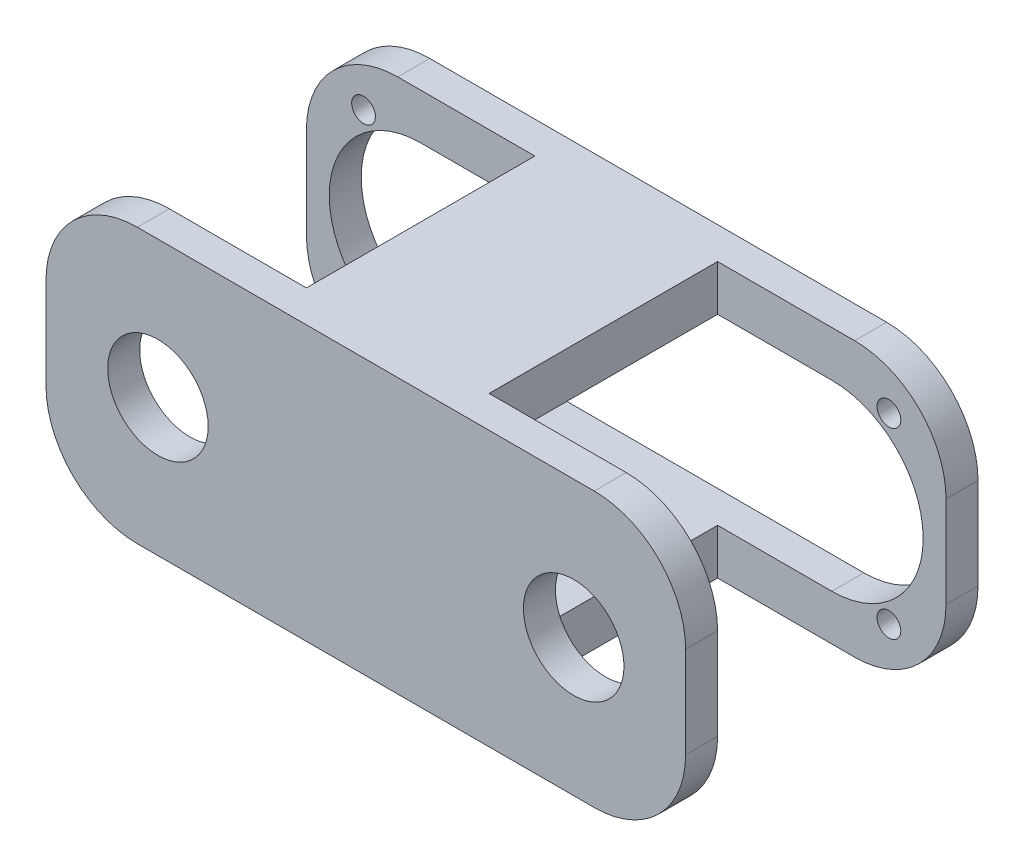
ISO-10303-21;
HEADER;
FILE_DESCRIPTION(('STEP AP214'),'2;1');
FILE_NAME('part.step','',(''),(''),'','','');
FILE_SCHEMA(('AUTOMOTIVE_DESIGN { 1 0 10303 214 1 1 1 1 }'));
ENDSEC;
DATA;
#1=APPLICATION_CONTEXT('core data for automotive mechanical design processes');
#2=APPLICATION_PROTOCOL_DEFINITION('international standard','automotive_design',2000,#1);
#3=PRODUCT_CONTEXT('',#1,'mechanical');
#4=PRODUCT('Part','Part','',(#3));
#5=PRODUCT_RELATED_PRODUCT_CATEGORY('part','',(#4));
#6=PRODUCT_DEFINITION_FORMATION('','',#4);
#7=PRODUCT_DEFINITION_CONTEXT('part definition',#1,'design');
#8=PRODUCT_DEFINITION('design','',#6,#7);
#9=PRODUCT_DEFINITION_SHAPE('','',#8);
#10=(LENGTH_UNIT() NAMED_UNIT(*) SI_UNIT(.MILLI.,.METRE.));
#11=(NAMED_UNIT(*) PLANE_ANGLE_UNIT() SI_UNIT($,.RADIAN.));
#12=(NAMED_UNIT(*) SI_UNIT($,.STERADIAN.) SOLID_ANGLE_UNIT());
#13=UNCERTAINTY_MEASURE_WITH_UNIT(LENGTH_MEASURE(1.E-05),#10,'distance_accuracy_value','');
#14=(GEOMETRIC_REPRESENTATION_CONTEXT(3) GLOBAL_UNCERTAINTY_ASSIGNED_CONTEXT((#13)) GLOBAL_UNIT_ASSIGNED_CONTEXT((#10,
#11,#12)) REPRESENTATION_CONTEXT('',''));
#15=CARTESIAN_POINT('',(0.,0.,0.));
#16=DIRECTION('',(0.,0.,1.));
#17=DIRECTION('',(1.,0.,0.));
#18=AXIS2_PLACEMENT_3D('',#15,#16,#17);
#19=CARTESIAN_POINT('',(-120.,20.,7.));
#20=DIRECTION('',(0.,0.,-1.));
#21=DIRECTION('',(-1.,0.,0.));
#22=AXIS2_PLACEMENT_3D('',#19,#20,#21);
#23=PLANE('',#22);
#24=CARTESIAN_POINT('',(-127.5,9.99999999999997,7.));
#25=DIRECTION('',(0.,0.,-1.));
#26=DIRECTION('',(-1.,0.,0.));
#27=AXIS2_PLACEMENT_3D('',#24,#25,#26);
#28=CIRCLE('',#27,2.60000000000002);
#29=CARTESIAN_POINT('',(-130.1,9.99999999999997,7.));
#30=VERTEX_POINT('',#29);
#31=EDGE_CURVE('E618',#30,#30,#28,.T.);
#32=ORIENTED_EDGE('',*,*,#31,.T.);
#33=EDGE_LOOP('',(#32));
#34=FACE_BOUND('',#33,.T.);
#35=CARTESIAN_POINT('',(-127.5,50.,7.));
#36=DIRECTION('',(0.,0.,-1.));
#37=DIRECTION('',(1.,0.,0.));
#38=AXIS2_PLACEMENT_3D('',#35,#36,#37);
#39=CIRCLE('',#38,2.60000000000002);
#40=CARTESIAN_POINT('',(-124.9,50.,7.));
#41=VERTEX_POINT('',#40);
#42=EDGE_CURVE('E626',#41,#41,#39,.T.);
#43=ORIENTED_EDGE('',*,*,#42,.T.);
#44=EDGE_LOOP('',(#43));
#45=FACE_BOUND('',#44,.T.);
#46=DIRECTION('',(0.,-1.,0.));
#47=VECTOR('',#46,1.);
#48=CARTESIAN_POINT('',(-90.,60.,7.));
#49=LINE('',#48,#47);
#50=CARTESIAN_POINT('',(-90.,60.,7.));
#51=VERTEX_POINT('',#50);
#52=CARTESIAN_POINT('',(-90.,50.,7.));
#53=VERTEX_POINT('',#52);
#54=EDGE_CURVE('E286',#51,#53,#49,.T.);
#55=ORIENTED_EDGE('',*,*,#54,.F.);
#56=DIRECTION('',(-1.,0.,0.));
#57=VECTOR('',#56,1.);
#58=CARTESIAN_POINT('',(-20.,60.,7.));
#59=LINE('',#58,#57);
#60=CARTESIAN_POINT('',(-120.,60.,7.));
#61=VERTEX_POINT('',#60);
#62=EDGE_CURVE('E400',#51,#61,#59,.T.);
#63=ORIENTED_EDGE('',*,*,#62,.T.);
#64=CARTESIAN_POINT('',(-120.,40.,7.));
#65=DIRECTION('',(0.,0.,1.));
#66=DIRECTION('',(1.,0.,0.));
#67=AXIS2_PLACEMENT_3D('',#64,#65,#66);
#68=CIRCLE('',#67,20.);
#69=CARTESIAN_POINT('',(-140.,40.,7.));
#70=VERTEX_POINT('',#69);
#71=EDGE_CURVE('E404',#61,#70,#68,.T.);
#72=ORIENTED_EDGE('',*,*,#71,.T.);
#73=DIRECTION('',(0.,-1.,0.));
#74=VECTOR('',#73,1.);
#75=CARTESIAN_POINT('',(-140.,20.,7.));
#76=LINE('',#75,#74);
#77=CARTESIAN_POINT('',(-140.,20.,7.));
#78=VERTEX_POINT('',#77);
#79=EDGE_CURVE('E407',#70,#78,#76,.T.);
#80=ORIENTED_EDGE('',*,*,#79,.T.);
#81=CARTESIAN_POINT('',(-120.,20.,7.));
#82=DIRECTION('',(0.,0.,1.));
#83=DIRECTION('',(-1.,0.,0.));
#84=AXIS2_PLACEMENT_3D('',#81,#82,#83);
#85=CIRCLE('',#84,20.);
#86=CARTESIAN_POINT('',(-120.,0.,7.));
#87=VERTEX_POINT('',#86);
#88=EDGE_CURVE('E382',#78,#87,#85,.T.);
#89=ORIENTED_EDGE('',*,*,#88,.T.);
#90=DIRECTION('',(1.,0.,0.));
#91=VECTOR('',#90,1.);
#92=CARTESIAN_POINT('',(-20.0000000000001,0.,7.));
#93=LINE('',#92,#91);
#94=CARTESIAN_POINT('',(-90.,0.,7.));
#95=VERTEX_POINT('',#94);
#96=EDGE_CURVE('E388',#87,#95,#93,.T.);
#97=ORIENTED_EDGE('',*,*,#96,.T.);
#98=DIRECTION('',(0.,-1.,0.));
#99=VECTOR('',#98,1.);
#100=CARTESIAN_POINT('',(-90.,0.,7.));
#101=LINE('',#100,#99);
#102=CARTESIAN_POINT('',(-90.,9.99999999999999,7.));
#103=VERTEX_POINT('',#102);
#104=EDGE_CURVE('E290',#103,#95,#101,.T.);
#105=ORIENTED_EDGE('',*,*,#104,.F.);
#106=DIRECTION('',(1.,0.,0.));
#107=VECTOR('',#106,1.);
#108=CARTESIAN_POINT('',(-115.,9.99999999999999,7.));
#109=LINE('',#108,#107);
#110=CARTESIAN_POINT('',(-115.,9.99999999999999,7.));
#111=VERTEX_POINT('',#110);
#112=EDGE_CURVE('E350',#111,#103,#109,.T.);
#113=ORIENTED_EDGE('',*,*,#112,.F.);
#114=CARTESIAN_POINT('',(-115.,30.,7.));
#115=DIRECTION('',(0.,0.,1.));
#116=DIRECTION('',(1.,0.,0.));
#117=AXIS2_PLACEMENT_3D('',#114,#115,#116);
#118=CIRCLE('',#117,20.);
#119=CARTESIAN_POINT('',(-115.,50.,7.));
#120=VERTEX_POINT('',#119);
#121=EDGE_CURVE('E345',#120,#111,#118,.T.);
#122=ORIENTED_EDGE('',*,*,#121,.F.);
#123=DIRECTION('',(-1.,0.,0.));
#124=VECTOR('',#123,1.);
#125=CARTESIAN_POINT('',(-115.,50.,7.));
#126=LINE('',#125,#124);
#127=EDGE_CURVE('E61',#53,#120,#126,.T.);
#128=ORIENTED_EDGE('',*,*,#127,.F.);
#129=EDGE_LOOP('',(#55,#63,#72,#80,#89,#97,#105,#113,#122,#128));
#130=FACE_BOUND('',#129,.T.);
#131=ADVANCED_FACE('F45',(#34,#45,#130),#23,.F.);
#132=CARTESIAN_POINT('',(-12.5,9.99999999999998,7.));
#133=DIRECTION('',(0.,0.,-1.));
#134=DIRECTION('',(1.,0.,0.));
#135=AXIS2_PLACEMENT_3D('',#132,#133,#134);
#136=CIRCLE('',#135,2.6);
#137=CARTESIAN_POINT('',(-9.9,9.99999999999998,7.));
#138=VERTEX_POINT('',#137);
#139=EDGE_CURVE('E610',#138,#138,#136,.T.);
#140=ORIENTED_EDGE('',*,*,#139,.T.);
#141=EDGE_LOOP('',(#140));
#142=FACE_BOUND('',#141,.T.);
#143=CARTESIAN_POINT('',(-12.5,50.,7.));
#144=DIRECTION('',(0.,0.,-1.));
#145=DIRECTION('',(-1.,0.,0.));
#146=AXIS2_PLACEMENT_3D('',#143,#144,#145);
#147=CIRCLE('',#146,2.60000000000001);
#148=CARTESIAN_POINT('',(-15.1,50.,7.));
#149=VERTEX_POINT('',#148);
#150=EDGE_CURVE('E598',#149,#149,#147,.T.);
#151=ORIENTED_EDGE('',*,*,#150,.T.);
#152=EDGE_LOOP('',(#151));
#153=FACE_BOUND('',#152,.T.);
#154=DIRECTION('',(0.,1.,0.));
#155=VECTOR('',#154,1.);
#156=CARTESIAN_POINT('',(-50.,60.,7.));
#157=LINE('',#156,#155);
#158=CARTESIAN_POINT('',(-50.,50.,7.));
#159=VERTEX_POINT('',#158);
#160=CARTESIAN_POINT('',(-50.,60.,7.));
#161=VERTEX_POINT('',#160);
#162=EDGE_CURVE('E69',#159,#161,#157,.T.);
#163=ORIENTED_EDGE('',*,*,#162,.F.);
#164=CARTESIAN_POINT('',(-25.,50.,7.));
#165=VERTEX_POINT('',#164);
#166=EDGE_CURVE('E342',#165,#159,#126,.T.);
#167=ORIENTED_EDGE('',*,*,#166,.F.);
#168=CARTESIAN_POINT('',(-25.,30.,7.));
#169=DIRECTION('',(0.,0.,1.));
#170=DIRECTION('',(1.,0.,0.));
#171=AXIS2_PLACEMENT_3D('',#168,#169,#170);
#172=CIRCLE('',#171,20.);
#173=CARTESIAN_POINT('',(-25.,9.99999999999999,7.));
#174=VERTEX_POINT('',#173);
#175=EDGE_CURVE('E338',#174,#165,#172,.T.);
#176=ORIENTED_EDGE('',*,*,#175,.F.);
#177=CARTESIAN_POINT('',(-50.,9.99999999999999,7.));
#178=VERTEX_POINT('',#177);
#179=EDGE_CURVE('E349',#178,#174,#109,.T.);
#180=ORIENTED_EDGE('',*,*,#179,.F.);
#181=DIRECTION('',(0.,1.,0.));
#182=VECTOR('',#181,1.);
#183=CARTESIAN_POINT('',(-50.,0.,7.));
#184=LINE('',#183,#182);
#185=CARTESIAN_POINT('',(-50.,0.,7.));
#186=VERTEX_POINT('',#185);
#187=EDGE_CURVE('E320',#186,#178,#184,.T.);
#188=ORIENTED_EDGE('',*,*,#187,.F.);
#189=CARTESIAN_POINT('',(-20.0000000000001,0.,7.));
#190=VERTEX_POINT('',#189);
#191=EDGE_CURVE('E386',#186,#190,#93,.T.);
#192=ORIENTED_EDGE('',*,*,#191,.T.);
#193=CARTESIAN_POINT('',(-20.,20.,7.));
#194=DIRECTION('',(0.,0.,1.));
#195=DIRECTION('',(1.,0.,0.));
#196=AXIS2_PLACEMENT_3D('',#193,#194,#195);
#197=CIRCLE('',#196,20.);
#198=CARTESIAN_POINT('',(0.,20.,7.));
#199=VERTEX_POINT('',#198);
#200=EDGE_CURVE('E391',#190,#199,#197,.T.);
#201=ORIENTED_EDGE('',*,*,#200,.T.);
#202=DIRECTION('',(0.,1.,0.));
#203=VECTOR('',#202,1.);
#204=CARTESIAN_POINT('',(0.,20.0000000000001,7.));
#205=LINE('',#204,#203);
#206=CARTESIAN_POINT('',(0.,40.,7.));
#207=VERTEX_POINT('',#206);
#208=EDGE_CURVE('E394',#199,#207,#205,.T.);
#209=ORIENTED_EDGE('',*,*,#208,.T.);
#210=CARTESIAN_POINT('',(-20.,40.,7.));
#211=DIRECTION('',(0.,0.,1.));
#212=DIRECTION('',(1.,0.,0.));
#213=AXIS2_PLACEMENT_3D('',#210,#211,#212);
#214=CIRCLE('',#213,20.);
#215=CARTESIAN_POINT('',(-20.,60.,7.));
#216=VERTEX_POINT('',#215);
#217=EDGE_CURVE('E397',#207,#216,#214,.T.);
#218=ORIENTED_EDGE('',*,*,#217,.T.);
#219=EDGE_CURVE('E401',#216,#161,#59,.T.);
#220=ORIENTED_EDGE('',*,*,#219,.T.);
#221=EDGE_LOOP('',(#163,#167,#176,#180,#188,#192,#201,#209,#218,#220));
#222=FACE_BOUND('',#221,.T.);
#223=ADVANCED_FACE('F481',(#142,#153,#222),#23,.F.);
#224=CARTESIAN_POINT('',(-120.,20.,0.));
#225=DIRECTION('',(0.,0.,-1.));
#226=DIRECTION('',(-1.,0.,0.));
#227=AXIS2_PLACEMENT_3D('',#224,#225,#226);
#228=PLANE('',#227);
#229=CARTESIAN_POINT('',(-12.5,9.99999999999998,0.));
#230=DIRECTION('',(0.,0.,-1.));
#231=DIRECTION('',(1.,0.,0.));
#232=AXIS2_PLACEMENT_3D('',#229,#230,#231);
#233=CIRCLE('',#232,2.6);
#234=CARTESIAN_POINT('',(-9.9,9.99999999999998,0.));
#235=VERTEX_POINT('',#234);
#236=EDGE_CURVE('E614',#235,#235,#233,.T.);
#237=ORIENTED_EDGE('',*,*,#236,.F.);
#238=EDGE_LOOP('',(#237));
#239=FACE_BOUND('',#238,.T.);
#240=CARTESIAN_POINT('',(-127.5,9.99999999999997,0.));
#241=DIRECTION('',(0.,0.,-1.));
#242=DIRECTION('',(-1.,0.,0.));
#243=AXIS2_PLACEMENT_3D('',#240,#241,#242);
#244=CIRCLE('',#243,2.60000000000002);
#245=CARTESIAN_POINT('',(-130.1,9.99999999999997,0.));
#246=VERTEX_POINT('',#245);
#247=EDGE_CURVE('E622',#246,#246,#244,.T.);
#248=ORIENTED_EDGE('',*,*,#247,.F.);
#249=EDGE_LOOP('',(#248));
#250=FACE_BOUND('',#249,.T.);
#251=CARTESIAN_POINT('',(-127.5,50.,0.));
#252=DIRECTION('',(0.,0.,-1.));
#253=DIRECTION('',(1.,0.,0.));
#254=AXIS2_PLACEMENT_3D('',#251,#252,#253);
#255=CIRCLE('',#254,2.60000000000002);
#256=CARTESIAN_POINT('',(-124.9,50.,0.));
#257=VERTEX_POINT('',#256);
#258=EDGE_CURVE('E606',#257,#257,#255,.T.);
#259=ORIENTED_EDGE('',*,*,#258,.F.);
#260=EDGE_LOOP('',(#259));
#261=FACE_BOUND('',#260,.T.);
#262=CARTESIAN_POINT('',(-12.5,50.,0.));
#263=DIRECTION('',(0.,0.,-1.));
#264=DIRECTION('',(-1.,0.,0.));
#265=AXIS2_PLACEMENT_3D('',#262,#263,#264);
#266=CIRCLE('',#265,2.60000000000001);
#267=CARTESIAN_POINT('',(-15.1,50.,0.));
#268=VERTEX_POINT('',#267);
#269=EDGE_CURVE('E602',#268,#268,#266,.T.);
#270=ORIENTED_EDGE('',*,*,#269,.F.);
#271=EDGE_LOOP('',(#270));
#272=FACE_BOUND('',#271,.T.);
#273=CARTESIAN_POINT('',(-120.,20.,0.));
#274=DIRECTION('',(0.,0.,1.));
#275=DIRECTION('',(-1.,0.,0.));
#276=AXIS2_PLACEMENT_3D('',#273,#274,#275);
#277=CIRCLE('',#276,20.);
#278=CARTESIAN_POINT('',(-140.,20.,0.));
#279=VERTEX_POINT('',#278);
#280=CARTESIAN_POINT('',(-120.,0.,0.));
#281=VERTEX_POINT('',#280);
#282=EDGE_CURVE('E381',#279,#281,#277,.T.);
#283=ORIENTED_EDGE('',*,*,#282,.F.);
#284=DIRECTION('',(0.,-1.,0.));
#285=VECTOR('',#284,1.);
#286=CARTESIAN_POINT('',(-140.,20.,0.));
#287=LINE('',#286,#285);
#288=CARTESIAN_POINT('',(-140.,40.,0.));
#289=VERTEX_POINT('',#288);
#290=EDGE_CURVE('E387',#289,#279,#287,.T.);
#291=ORIENTED_EDGE('',*,*,#290,.F.);
#292=CARTESIAN_POINT('',(-120.,40.,0.));
#293=DIRECTION('',(0.,0.,1.));
#294=DIRECTION('',(1.,0.,0.));
#295=AXIS2_PLACEMENT_3D('',#292,#293,#294);
#296=CIRCLE('',#295,20.);
#297=CARTESIAN_POINT('',(-120.,60.,0.));
#298=VERTEX_POINT('',#297);
#299=EDGE_CURVE('E429',#298,#289,#296,.T.);
#300=ORIENTED_EDGE('',*,*,#299,.F.);
#301=DIRECTION('',(-1.,0.,0.));
#302=VECTOR('',#301,1.);
#303=CARTESIAN_POINT('',(-20.,60.,0.));
#304=LINE('',#303,#302);
#305=CARTESIAN_POINT('',(-20.,60.,0.));
#306=VERTEX_POINT('',#305);
#307=EDGE_CURVE('E426',#306,#298,#304,.T.);
#308=ORIENTED_EDGE('',*,*,#307,.F.);
#309=CARTESIAN_POINT('',(-20.,40.,0.));
#310=DIRECTION('',(0.,0.,1.));
#311=DIRECTION('',(1.,0.,0.));
#312=AXIS2_PLACEMENT_3D('',#309,#310,#311);
#313=CIRCLE('',#312,20.);
#314=CARTESIAN_POINT('',(0.,40.,0.));
#315=VERTEX_POINT('',#314);
#316=EDGE_CURVE('E423',#315,#306,#313,.T.);
#317=ORIENTED_EDGE('',*,*,#316,.F.);
#318=DIRECTION('',(0.,1.,0.));
#319=VECTOR('',#318,1.);
#320=CARTESIAN_POINT('',(0.,20.0000000000001,0.));
#321=LINE('',#320,#319);
#322=CARTESIAN_POINT('',(0.,20.,0.));
#323=VERTEX_POINT('',#322);
#324=EDGE_CURVE('E420',#323,#315,#321,.T.);
#325=ORIENTED_EDGE('',*,*,#324,.F.);
#326=CARTESIAN_POINT('',(-20.,20.,0.));
#327=DIRECTION('',(0.,0.,1.));
#328=DIRECTION('',(1.,0.,0.));
#329=AXIS2_PLACEMENT_3D('',#326,#327,#328);
#330=CIRCLE('',#329,20.);
#331=CARTESIAN_POINT('',(-20.0000000000001,0.,0.));
#332=VERTEX_POINT('',#331);
#333=EDGE_CURVE('E417',#332,#323,#330,.T.);
#334=ORIENTED_EDGE('',*,*,#333,.F.);
#335=DIRECTION('',(1.,0.,0.));
#336=VECTOR('',#335,1.);
#337=CARTESIAN_POINT('',(-20.0000000000001,0.,0.));
#338=LINE('',#337,#336);
#339=EDGE_CURVE('E414',#281,#332,#338,.T.);
#340=ORIENTED_EDGE('',*,*,#339,.F.);
#341=EDGE_LOOP('',(#283,#291,#300,#308,#317,#325,#334,#340));
#342=FACE_BOUND('',#341,.T.);
#343=DIRECTION('',(1.,0.,0.));
#344=VECTOR('',#343,1.);
#345=CARTESIAN_POINT('',(-115.,9.99999999999999,0.));
#346=LINE('',#345,#344);
#347=CARTESIAN_POINT('',(-115.,9.99999999999999,0.));
#348=VERTEX_POINT('',#347);
#349=CARTESIAN_POINT('',(-25.,9.99999999999999,0.));
#350=VERTEX_POINT('',#349);
#351=EDGE_CURVE('E341',#348,#350,#346,.T.);
#352=ORIENTED_EDGE('',*,*,#351,.T.);
#353=CARTESIAN_POINT('',(-25.,30.,0.));
#354=DIRECTION('',(0.,0.,1.));
#355=DIRECTION('',(-1.,0.,0.));
#356=AXIS2_PLACEMENT_3D('',#353,#354,#355);
#357=CIRCLE('',#356,20.);
#358=CARTESIAN_POINT('',(-25.,50.,0.));
#359=VERTEX_POINT('',#358);
#360=EDGE_CURVE('E306',#350,#359,#357,.T.);
#361=ORIENTED_EDGE('',*,*,#360,.T.);
#362=DIRECTION('',(-1.,0.,0.));
#363=VECTOR('',#362,1.);
#364=CARTESIAN_POINT('',(-115.,50.,0.));
#365=LINE('',#364,#363);
#366=CARTESIAN_POINT('',(-115.,50.,0.));
#367=VERTEX_POINT('',#366);
#368=EDGE_CURVE('E358',#359,#367,#365,.T.);
#369=ORIENTED_EDGE('',*,*,#368,.T.);
#370=CARTESIAN_POINT('',(-115.,30.,0.));
#371=DIRECTION('',(0.,0.,1.));
#372=DIRECTION('',(1.,0.,0.));
#373=AXIS2_PLACEMENT_3D('',#370,#371,#372);
#374=CIRCLE('',#373,20.);
#375=EDGE_CURVE('E362',#367,#348,#374,.T.);
#376=ORIENTED_EDGE('',*,*,#375,.T.);
#377=EDGE_LOOP('',(#352,#361,#369,#376));
#378=FACE_BOUND('',#377,.T.);
#379=ADVANCED_FACE('F468',(#239,#250,#261,#272,#342,#378),#228,.T.);
#380=CARTESIAN_POINT('',(-120.,20.,7.));
#381=DIRECTION('',(0.,0.,-1.));
#382=DIRECTION('',(-1.,0.,0.));
#383=AXIS2_PLACEMENT_3D('',#380,#381,#382);
#384=CYLINDRICAL_SURFACE('',#383,20.);
#385=ORIENTED_EDGE('',*,*,#282,.T.);
#386=DIRECTION('',(0.,0.,-1.));
#387=VECTOR('',#386,1.);
#388=CARTESIAN_POINT('',(-120.,0.,7.));
#389=LINE('',#388,#387);
#390=EDGE_CURVE('E11',#87,#281,#389,.T.);
#391=ORIENTED_EDGE('',*,*,#390,.F.);
#392=ORIENTED_EDGE('',*,*,#88,.F.);
#393=DIRECTION('',(0.,0.,-1.));
#394=VECTOR('',#393,1.);
#395=CARTESIAN_POINT('',(-140.,20.,7.));
#396=LINE('',#395,#394);
#397=EDGE_CURVE('E410',#78,#279,#396,.T.);
#398=ORIENTED_EDGE('',*,*,#397,.T.);
#399=EDGE_LOOP('',(#385,#391,#392,#398));
#400=FACE_BOUND('',#399,.T.);
#401=ADVANCED_FACE('F47',(#400),#384,.T.);
#402=CARTESIAN_POINT('',(-20.0000000000001,0.,7.));
#403=DIRECTION('',(0.,1.,0.));
#404=DIRECTION('',(-1.,0.,0.));
#405=AXIS2_PLACEMENT_3D('',#402,#403,#404);
#406=PLANE('',#405);
#407=ORIENTED_EDGE('',*,*,#339,.T.);
#408=DIRECTION('',(0.,0.,-1.));
#409=VECTOR('',#408,1.);
#410=CARTESIAN_POINT('',(-20.0000000000001,0.,7.));
#411=LINE('',#410,#409);
#412=EDGE_CURVE('E54',#190,#332,#411,.T.);
#413=ORIENTED_EDGE('',*,*,#412,.F.);
#414=ORIENTED_EDGE('',*,*,#191,.F.);
#415=DIRECTION('',(0.,0.,-1.));
#416=VECTOR('',#415,1.);
#417=CARTESIAN_POINT('',(-50.,0.,57.));
#418=LINE('',#417,#416);
#419=CARTESIAN_POINT('',(-50.,0.,57.));
#420=VERTEX_POINT('',#419);
#421=EDGE_CURVE('E267',#420,#186,#418,.T.);
#422=ORIENTED_EDGE('',*,*,#421,.F.);
#423=DIRECTION('',(1.,0.,0.));
#424=VECTOR('',#423,1.);
#425=CARTESIAN_POINT('',(-120.,0.,57.));
#426=LINE('',#425,#424);
#427=CARTESIAN_POINT('',(-20.0000000000001,0.,57.));
#428=VERTEX_POINT('',#427);
#429=EDGE_CURVE('E505',#420,#428,#426,.T.);
#430=ORIENTED_EDGE('',*,*,#429,.T.);
#431=DIRECTION('',(0.,0.,-1.));
#432=VECTOR('',#431,1.);
#433=CARTESIAN_POINT('',(-20.0000000000001,0.,64.));
#434=LINE('',#433,#432);
#435=CARTESIAN_POINT('',(-20.0000000000001,0.,64.));
#436=VERTEX_POINT('',#435);
#437=EDGE_CURVE('E240',#436,#428,#434,.T.);
#438=ORIENTED_EDGE('',*,*,#437,.F.);
#439=DIRECTION('',(1.,0.,0.));
#440=VECTOR('',#439,1.);
#441=CARTESIAN_POINT('',(-120.,0.,64.));
#442=LINE('',#441,#440);
#443=CARTESIAN_POINT('',(-120.,0.,64.));
#444=VERTEX_POINT('',#443);
#445=EDGE_CURVE('E232',#444,#436,#442,.T.);
#446=ORIENTED_EDGE('',*,*,#445,.F.);
#447=DIRECTION('',(0.,0.,-1.));
#448=VECTOR('',#447,1.);
#449=CARTESIAN_POINT('',(-120.,0.,64.));
#450=LINE('',#449,#448);
#451=CARTESIAN_POINT('',(-120.,0.,57.));
#452=VERTEX_POINT('',#451);
#453=EDGE_CURVE('E237',#444,#452,#450,.T.);
#454=ORIENTED_EDGE('',*,*,#453,.T.);
#455=CARTESIAN_POINT('',(-90.,0.,57.));
#456=VERTEX_POINT('',#455);
#457=EDGE_CURVE('E502',#452,#456,#426,.T.);
#458=ORIENTED_EDGE('',*,*,#457,.T.);
#459=DIRECTION('',(0.,0.,-1.));
#460=VECTOR('',#459,1.);
#461=CARTESIAN_POINT('',(-90.,0.,57.));
#462=LINE('',#461,#460);
#463=EDGE_CURVE('E262',#456,#95,#462,.T.);
#464=ORIENTED_EDGE('',*,*,#463,.T.);
#465=ORIENTED_EDGE('',*,*,#96,.F.);
#466=ORIENTED_EDGE('',*,*,#390,.T.);
#467=EDGE_LOOP('',(#407,#413,#414,#422,#430,#438,#446,#454,#458,#464,#465,#466));
#468=FACE_BOUND('',#467,.T.);
#469=ADVANCED_FACE('F234',(#468),#406,.F.);
#470=CARTESIAN_POINT('',(-20.,20.,7.));
#471=DIRECTION('',(0.,0.,-1.));
#472=DIRECTION('',(-1.,0.,0.));
#473=AXIS2_PLACEMENT_3D('',#470,#471,#472);
#474=CYLINDRICAL_SURFACE('',#473,20.);
#475=ORIENTED_EDGE('',*,*,#333,.T.);
#476=DIRECTION('',(0.,0.,-1.));
#477=VECTOR('',#476,1.);
#478=CARTESIAN_POINT('',(0.,20.,7.));
#479=LINE('',#478,#477);
#480=EDGE_CURVE('E453',#199,#323,#479,.T.);
#481=ORIENTED_EDGE('',*,*,#480,.F.);
#482=ORIENTED_EDGE('',*,*,#200,.F.);
#483=ORIENTED_EDGE('',*,*,#412,.T.);
#484=EDGE_LOOP('',(#475,#481,#482,#483));
#485=FACE_BOUND('',#484,.T.);
#486=ADVANCED_FACE('F462',(#485),#474,.T.);
#487=CARTESIAN_POINT('',(0.,20.0000000000001,7.));
#488=DIRECTION('',(-1.,0.,0.));
#489=DIRECTION('',(0.,0.,1.));
#490=AXIS2_PLACEMENT_3D('',#487,#488,#489);
#491=PLANE('',#490);
#492=ORIENTED_EDGE('',*,*,#324,.T.);
#493=DIRECTION('',(0.,0.,-1.));
#494=VECTOR('',#493,1.);
#495=CARTESIAN_POINT('',(0.,40.,7.));
#496=LINE('',#495,#494);
#497=EDGE_CURVE('E449',#207,#315,#496,.T.);
#498=ORIENTED_EDGE('',*,*,#497,.F.);
#499=ORIENTED_EDGE('',*,*,#208,.F.);
#500=ORIENTED_EDGE('',*,*,#480,.T.);
#501=EDGE_LOOP('',(#492,#498,#499,#500));
#502=FACE_BOUND('',#501,.T.);
#503=ADVANCED_FACE('F474',(#502),#491,.F.);
#504=CARTESIAN_POINT('',(-20.,40.,7.));
#505=DIRECTION('',(0.,0.,-1.));
#506=DIRECTION('',(-1.,0.,0.));
#507=AXIS2_PLACEMENT_3D('',#504,#505,#506);
#508=CYLINDRICAL_SURFACE('',#507,20.);
#509=ORIENTED_EDGE('',*,*,#316,.T.);
#510=DIRECTION('',(0.,0.,-1.));
#511=VECTOR('',#510,1.);
#512=CARTESIAN_POINT('',(-20.,60.,7.));
#513=LINE('',#512,#511);
#514=EDGE_CURVE('E445',#216,#306,#513,.T.);
#515=ORIENTED_EDGE('',*,*,#514,.F.);
#516=ORIENTED_EDGE('',*,*,#217,.F.);
#517=ORIENTED_EDGE('',*,*,#497,.T.);
#518=EDGE_LOOP('',(#509,#515,#516,#517));
#519=FACE_BOUND('',#518,.T.);
#520=ADVANCED_FACE('F478',(#519),#508,.T.);
#521=CARTESIAN_POINT('',(-20.,60.,7.));
#522=DIRECTION('',(0.,-1.,0.));
#523=DIRECTION('',(1.,0.,0.));
#524=AXIS2_PLACEMENT_3D('',#521,#522,#523);
#525=PLANE('',#524);
#526=ORIENTED_EDGE('',*,*,#307,.T.);
#527=DIRECTION('',(0.,0.,-1.));
#528=VECTOR('',#527,1.);
#529=CARTESIAN_POINT('',(-120.,60.,7.));
#530=LINE('',#529,#528);
#531=EDGE_CURVE('E441',#61,#298,#530,.T.);
#532=ORIENTED_EDGE('',*,*,#531,.F.);
#533=ORIENTED_EDGE('',*,*,#62,.F.);
#534=DIRECTION('',(0.,0.,-1.));
#535=VECTOR('',#534,1.);
#536=CARTESIAN_POINT('',(-90.,60.,57.));
#537=LINE('',#536,#535);
#538=CARTESIAN_POINT('',(-90.,60.,57.));
#539=VERTEX_POINT('',#538);
#540=EDGE_CURVE('E285',#539,#51,#537,.T.);
#541=ORIENTED_EDGE('',*,*,#540,.F.);
#542=DIRECTION('',(-1.,0.,0.));
#543=VECTOR('',#542,1.);
#544=CARTESIAN_POINT('',(-120.,60.,57.));
#545=LINE('',#544,#543);
#546=CARTESIAN_POINT('',(-120.,60.,57.));
#547=VERTEX_POINT('',#546);
#548=EDGE_CURVE('E519',#539,#547,#545,.T.);
#549=ORIENTED_EDGE('',*,*,#548,.T.);
#550=DIRECTION('',(0.,0.,-1.));
#551=VECTOR('',#550,1.);
#552=CARTESIAN_POINT('',(-120.,60.,64.));
#553=LINE('',#552,#551);
#554=CARTESIAN_POINT('',(-120.,60.,64.));
#555=VERTEX_POINT('',#554);
#556=EDGE_CURVE('E536',#555,#547,#553,.T.);
#557=ORIENTED_EDGE('',*,*,#556,.F.);
#558=DIRECTION('',(-1.,0.,0.));
#559=VECTOR('',#558,1.);
#560=CARTESIAN_POINT('',(-120.,60.,64.));
#561=LINE('',#560,#559);
#562=CARTESIAN_POINT('',(-20.,60.,64.));
#563=VERTEX_POINT('',#562);
#564=EDGE_CURVE('E569',#563,#555,#561,.T.);
#565=ORIENTED_EDGE('',*,*,#564,.F.);
#566=DIRECTION('',(0.,0.,-1.));
#567=VECTOR('',#566,1.);
#568=CARTESIAN_POINT('',(-20.,60.,64.));
#569=LINE('',#568,#567);
#570=CARTESIAN_POINT('',(-20.,60.,57.));
#571=VERTEX_POINT('',#570);
#572=EDGE_CURVE('E540',#563,#571,#569,.T.);
#573=ORIENTED_EDGE('',*,*,#572,.T.);
#574=CARTESIAN_POINT('',(-50.,60.,57.));
#575=VERTEX_POINT('',#574);
#576=EDGE_CURVE('E520',#571,#575,#545,.T.);
#577=ORIENTED_EDGE('',*,*,#576,.T.);
#578=DIRECTION('',(0.,0.,-1.));
#579=VECTOR('',#578,1.);
#580=CARTESIAN_POINT('',(-50.,60.,57.));
#581=LINE('',#580,#579);
#582=EDGE_CURVE('E296',#575,#161,#581,.T.);
#583=ORIENTED_EDGE('',*,*,#582,.T.);
#584=ORIENTED_EDGE('',*,*,#219,.F.);
#585=ORIENTED_EDGE('',*,*,#514,.T.);
#586=EDGE_LOOP('',(#526,#532,#533,#541,#549,#557,#565,#573,#577,#583,#584,#585));
#587=FACE_BOUND('',#586,.T.);
#588=ADVANCED_FACE('F567',(#587),#525,.F.);
#589=CARTESIAN_POINT('',(-120.,40.,7.));
#590=DIRECTION('',(0.,0.,-1.));
#591=DIRECTION('',(-1.,0.,0.));
#592=AXIS2_PLACEMENT_3D('',#589,#590,#591);
#593=CYLINDRICAL_SURFACE('',#592,20.);
#594=ORIENTED_EDGE('',*,*,#299,.T.);
#595=DIRECTION('',(0.,0.,-1.));
#596=VECTOR('',#595,1.);
#597=CARTESIAN_POINT('',(-140.,40.,7.));
#598=LINE('',#597,#596);
#599=EDGE_CURVE('E437',#70,#289,#598,.T.);
#600=ORIENTED_EDGE('',*,*,#599,.F.);
#601=ORIENTED_EDGE('',*,*,#71,.F.);
#602=ORIENTED_EDGE('',*,*,#531,.T.);
#603=EDGE_LOOP('',(#594,#600,#601,#602));
#604=FACE_BOUND('',#603,.T.);
#605=ADVANCED_FACE('F674',(#604),#593,.T.);
#606=CARTESIAN_POINT('',(-140.,20.,7.));
#607=DIRECTION('',(1.,0.,0.));
#608=DIRECTION('',(0.,0.,-1.));
#609=AXIS2_PLACEMENT_3D('',#606,#607,#608);
#610=PLANE('',#609);
#611=ORIENTED_EDGE('',*,*,#290,.T.);
#612=ORIENTED_EDGE('',*,*,#397,.F.);
#613=ORIENTED_EDGE('',*,*,#79,.F.);
#614=ORIENTED_EDGE('',*,*,#599,.T.);
#615=EDGE_LOOP('',(#611,#612,#613,#614));
#616=FACE_BOUND('',#615,.T.);
#617=ADVANCED_FACE('F671',(#616),#610,.F.);
#618=CARTESIAN_POINT('',(-25.,30.,7.));
#619=DIRECTION('',(0.,0.,-1.));
#620=DIRECTION('',(-1.,0.,0.));
#621=AXIS2_PLACEMENT_3D('',#618,#619,#620);
#622=CYLINDRICAL_SURFACE('',#621,20.);
#623=ORIENTED_EDGE('',*,*,#360,.F.);
#624=DIRECTION('',(0.,0.,-1.));
#625=VECTOR('',#624,1.);
#626=CARTESIAN_POINT('',(-25.,9.99999999999999,7.));
#627=LINE('',#626,#625);
#628=EDGE_CURVE('E354',#174,#350,#627,.T.);
#629=ORIENTED_EDGE('',*,*,#628,.F.);
#630=ORIENTED_EDGE('',*,*,#175,.T.);
#631=DIRECTION('',(0.,0.,-1.));
#632=VECTOR('',#631,1.);
#633=CARTESIAN_POINT('',(-25.,50.,7.));
#634=LINE('',#633,#632);
#635=EDGE_CURVE('E378',#165,#359,#634,.T.);
#636=ORIENTED_EDGE('',*,*,#635,.T.);
#637=EDGE_LOOP('',(#623,#629,#630,#636));
#638=FACE_BOUND('',#637,.T.);
#639=ADVANCED_FACE('F668',(#638),#622,.F.);
#640=CARTESIAN_POINT('',(-115.,50.,7.));
#641=DIRECTION('',(0.,-1.,0.));
#642=DIRECTION('',(0.,0.,-1.));
#643=AXIS2_PLACEMENT_3D('',#640,#641,#642);
#644=PLANE('',#643);
#645=ORIENTED_EDGE('',*,*,#368,.F.);
#646=ORIENTED_EDGE('',*,*,#635,.F.);
#647=ORIENTED_EDGE('',*,*,#166,.T.);
#648=DIRECTION('',(0.,0.,-1.));
#649=VECTOR('',#648,1.);
#650=CARTESIAN_POINT('',(-50.,50.,57.));
#651=LINE('',#650,#649);
#652=CARTESIAN_POINT('',(-50.,50.,57.));
#653=VERTEX_POINT('',#652);
#654=EDGE_CURVE('E300',#653,#159,#651,.T.);
#655=ORIENTED_EDGE('',*,*,#654,.F.);
#656=DIRECTION('',(1.,0.,0.));
#657=VECTOR('',#656,1.);
#658=CARTESIAN_POINT('',(-90.,50.,57.));
#659=LINE('',#658,#657);
#660=CARTESIAN_POINT('',(-90.,50.,57.));
#661=VERTEX_POINT('',#660);
#662=EDGE_CURVE('E277',#661,#653,#659,.T.);
#663=ORIENTED_EDGE('',*,*,#662,.F.);
#664=DIRECTION('',(0.,0.,-1.));
#665=VECTOR('',#664,1.);
#666=CARTESIAN_POINT('',(-90.,50.,57.));
#667=LINE('',#666,#665);
#668=EDGE_CURVE('E304',#661,#53,#667,.T.);
#669=ORIENTED_EDGE('',*,*,#668,.T.);
#670=ORIENTED_EDGE('',*,*,#127,.T.);
#671=DIRECTION('',(0.,0.,-1.));
#672=VECTOR('',#671,1.);
#673=CARTESIAN_POINT('',(-115.,50.,7.));
#674=LINE('',#673,#672);
#675=EDGE_CURVE('E374',#120,#367,#674,.T.);
#676=ORIENTED_EDGE('',*,*,#675,.T.);
#677=EDGE_LOOP('',(#645,#646,#647,#655,#663,#669,#670,#676));
#678=FACE_BOUND('',#677,.T.);
#679=ADVANCED_FACE('F488',(#678),#644,.T.);
#680=CARTESIAN_POINT('',(-115.,30.,7.));
#681=DIRECTION('',(0.,0.,-1.));
#682=DIRECTION('',(-1.,0.,0.));
#683=AXIS2_PLACEMENT_3D('',#680,#681,#682);
#684=CYLINDRICAL_SURFACE('',#683,20.);
#685=ORIENTED_EDGE('',*,*,#375,.F.);
#686=ORIENTED_EDGE('',*,*,#675,.F.);
#687=ORIENTED_EDGE('',*,*,#121,.T.);
#688=DIRECTION('',(0.,0.,-1.));
#689=VECTOR('',#688,1.);
#690=CARTESIAN_POINT('',(-115.,9.99999999999999,7.));
#691=LINE('',#690,#689);
#692=EDGE_CURVE('E371',#111,#348,#691,.T.);
#693=ORIENTED_EDGE('',*,*,#692,.T.);
#694=EDGE_LOOP('',(#685,#686,#687,#693));
#695=FACE_BOUND('',#694,.T.);
#696=ADVANCED_FACE('F491',(#695),#684,.F.);
#697=CARTESIAN_POINT('',(-115.,9.99999999999999,7.));
#698=DIRECTION('',(0.,1.,0.));
#699=DIRECTION('',(0.,0.,1.));
#700=AXIS2_PLACEMENT_3D('',#697,#698,#699);
#701=PLANE('',#700);
#702=ORIENTED_EDGE('',*,*,#351,.F.);
#703=ORIENTED_EDGE('',*,*,#692,.F.);
#704=ORIENTED_EDGE('',*,*,#112,.T.);
#705=DIRECTION('',(0.,0.,-1.));
#706=VECTOR('',#705,1.);
#707=CARTESIAN_POINT('',(-90.,9.99999999999999,57.));
#708=LINE('',#707,#706);
#709=CARTESIAN_POINT('',(-90.,9.99999999999999,57.));
#710=VERTEX_POINT('',#709);
#711=EDGE_CURVE('E315',#710,#103,#708,.T.);
#712=ORIENTED_EDGE('',*,*,#711,.F.);
#713=DIRECTION('',(-1.,0.,0.));
#714=VECTOR('',#713,1.);
#715=CARTESIAN_POINT('',(-90.,9.99999999999999,57.));
#716=LINE('',#715,#714);
#717=CARTESIAN_POINT('',(-50.,9.99999999999999,57.));
#718=VERTEX_POINT('',#717);
#719=EDGE_CURVE('E319',#718,#710,#716,.T.);
#720=ORIENTED_EDGE('',*,*,#719,.F.);
#721=DIRECTION('',(0.,0.,-1.));
#722=VECTOR('',#721,1.);
#723=CARTESIAN_POINT('',(-50.,9.99999999999999,57.));
#724=LINE('',#723,#722);
#725=EDGE_CURVE('E311',#718,#178,#724,.T.);
#726=ORIENTED_EDGE('',*,*,#725,.T.);
#727=ORIENTED_EDGE('',*,*,#179,.T.);
#728=ORIENTED_EDGE('',*,*,#628,.T.);
#729=EDGE_LOOP('',(#702,#703,#704,#712,#720,#726,#727,#728));
#730=FACE_BOUND('',#729,.T.);
#731=ADVANCED_FACE('F496',(#730),#701,.T.);
#732=CARTESIAN_POINT('',(-90.,0.,57.));
#733=DIRECTION('',(1.,0.,0.));
#734=DIRECTION('',(0.,0.,-1.));
#735=AXIS2_PLACEMENT_3D('',#732,#733,#734);
#736=PLANE('',#735);
#737=ORIENTED_EDGE('',*,*,#104,.T.);
#738=ORIENTED_EDGE('',*,*,#463,.F.);
#739=DIRECTION('',(0.,-1.,0.));
#740=VECTOR('',#739,1.);
#741=CARTESIAN_POINT('',(-90.,0.,57.));
#742=LINE('',#741,#740);
#743=EDGE_CURVE('E324',#710,#456,#742,.T.);
#744=ORIENTED_EDGE('',*,*,#743,.F.);
#745=ORIENTED_EDGE('',*,*,#711,.T.);
#746=EDGE_LOOP('',(#737,#738,#744,#745));
#747=FACE_BOUND('',#746,.T.);
#748=ADVANCED_FACE('F499',(#747),#736,.F.);
#749=CARTESIAN_POINT('',(-50.,0.,57.));
#750=DIRECTION('',(-1.,0.,0.));
#751=DIRECTION('',(0.,0.,1.));
#752=AXIS2_PLACEMENT_3D('',#749,#750,#751);
#753=PLANE('',#752);
#754=ORIENTED_EDGE('',*,*,#187,.T.);
#755=ORIENTED_EDGE('',*,*,#725,.F.);
#756=DIRECTION('',(0.,1.,0.));
#757=VECTOR('',#756,1.);
#758=CARTESIAN_POINT('',(-50.,0.,57.));
#759=LINE('',#758,#757);
#760=EDGE_CURVE('E331',#420,#718,#759,.T.);
#761=ORIENTED_EDGE('',*,*,#760,.F.);
#762=ORIENTED_EDGE('',*,*,#421,.T.);
#763=EDGE_LOOP('',(#754,#755,#761,#762));
#764=FACE_BOUND('',#763,.T.);
#765=ADVANCED_FACE('F745',(#764),#753,.F.);
#766=CARTESIAN_POINT('',(-90.,60.,57.));
#767=DIRECTION('',(1.,0.,0.));
#768=DIRECTION('',(0.,0.,-1.));
#769=AXIS2_PLACEMENT_3D('',#766,#767,#768);
#770=PLANE('',#769);
#771=ORIENTED_EDGE('',*,*,#54,.T.);
#772=ORIENTED_EDGE('',*,*,#668,.F.);
#773=DIRECTION('',(0.,-1.,0.));
#774=VECTOR('',#773,1.);
#775=CARTESIAN_POINT('',(-90.,60.,57.));
#776=LINE('',#775,#774);
#777=EDGE_CURVE('E273',#539,#661,#776,.T.);
#778=ORIENTED_EDGE('',*,*,#777,.F.);
#779=ORIENTED_EDGE('',*,*,#540,.T.);
#780=EDGE_LOOP('',(#771,#772,#778,#779));
#781=FACE_BOUND('',#780,.T.);
#782=ADVANCED_FACE('F710',(#781),#770,.F.);
#783=CARTESIAN_POINT('',(-50.,60.,57.));
#784=DIRECTION('',(-1.,0.,0.));
#785=DIRECTION('',(0.,0.,1.));
#786=AXIS2_PLACEMENT_3D('',#783,#784,#785);
#787=PLANE('',#786);
#788=ORIENTED_EDGE('',*,*,#162,.T.);
#789=ORIENTED_EDGE('',*,*,#582,.F.);
#790=DIRECTION('',(0.,1.,0.));
#791=VECTOR('',#790,1.);
#792=CARTESIAN_POINT('',(-50.,60.,57.));
#793=LINE('',#792,#791);
#794=EDGE_CURVE('E281',#653,#575,#793,.T.);
#795=ORIENTED_EDGE('',*,*,#794,.F.);
#796=ORIENTED_EDGE('',*,*,#654,.T.);
#797=EDGE_LOOP('',(#788,#789,#795,#796));
#798=FACE_BOUND('',#797,.T.);
#799=ADVANCED_FACE('F706',(#798),#787,.F.);
#800=CARTESIAN_POINT('',(-120.,20.,57.));
#801=DIRECTION('',(0.,0.,1.));
#802=DIRECTION('',(1.,0.,0.));
#803=AXIS2_PLACEMENT_3D('',#800,#801,#802);
#804=PLANE('',#803);
#805=CARTESIAN_POINT('',(-115.5,30.,57.));
#806=DIRECTION('',(0.,0.,1.));
#807=DIRECTION('',(1.,0.,0.));
#808=AXIS2_PLACEMENT_3D('',#805,#806,#807);
#809=CIRCLE('',#808,11.);
#810=CARTESIAN_POINT('',(-104.5,30.,57.));
#811=VERTEX_POINT('',#810);
#812=EDGE_CURVE('E585',#811,#811,#809,.T.);
#813=ORIENTED_EDGE('',*,*,#812,.T.);
#814=EDGE_LOOP('',(#813));
#815=FACE_BOUND('',#814,.T.);
#816=CARTESIAN_POINT('',(-24.5,30.,57.));
#817=DIRECTION('',(0.,0.,1.));
#818=DIRECTION('',(-1.,0.,0.));
#819=AXIS2_PLACEMENT_3D('',#816,#817,#818);
#820=CIRCLE('',#819,11.);
#821=CARTESIAN_POINT('',(-35.5,30.,57.));
#822=VERTEX_POINT('',#821);
#823=EDGE_CURVE('E594',#822,#822,#820,.T.);
#824=ORIENTED_EDGE('',*,*,#823,.T.);
#825=EDGE_LOOP('',(#824));
#826=FACE_BOUND('',#825,.T.);
#827=ORIENTED_EDGE('',*,*,#719,.T.);
#828=ORIENTED_EDGE('',*,*,#743,.T.);
#829=ORIENTED_EDGE('',*,*,#457,.F.);
#830=CARTESIAN_POINT('',(-120.,20.,57.));
#831=DIRECTION('',(0.,0.,1.));
#832=DIRECTION('',(1.,0.,0.));
#833=AXIS2_PLACEMENT_3D('',#830,#831,#832);
#834=CIRCLE('',#833,20.);
#835=CARTESIAN_POINT('',(-140.,20.,57.));
#836=VERTEX_POINT('',#835);
#837=EDGE_CURVE('E260',#836,#452,#834,.T.);
#838=ORIENTED_EDGE('',*,*,#837,.F.);
#839=DIRECTION('',(0.,-1.,0.));
#840=VECTOR('',#839,1.);
#841=CARTESIAN_POINT('',(-140.,40.,57.));
#842=LINE('',#841,#840);
#843=CARTESIAN_POINT('',(-140.,40.,57.));
#844=VERTEX_POINT('',#843);
#845=EDGE_CURVE('E256',#844,#836,#842,.T.);
#846=ORIENTED_EDGE('',*,*,#845,.F.);
#847=CARTESIAN_POINT('',(-120.,40.,57.));
#848=DIRECTION('',(0.,0.,1.));
#849=DIRECTION('',(1.,0.,0.));
#850=AXIS2_PLACEMENT_3D('',#847,#848,#849);
#851=CIRCLE('',#850,20.);
#852=EDGE_CURVE('E524',#547,#844,#851,.T.);
#853=ORIENTED_EDGE('',*,*,#852,.F.);
#854=ORIENTED_EDGE('',*,*,#548,.F.);
#855=ORIENTED_EDGE('',*,*,#777,.T.);
#856=ORIENTED_EDGE('',*,*,#662,.T.);
#857=ORIENTED_EDGE('',*,*,#794,.T.);
#858=ORIENTED_EDGE('',*,*,#576,.F.);
#859=CARTESIAN_POINT('',(-20.,40.,57.));
#860=DIRECTION('',(0.,0.,1.));
#861=DIRECTION('',(-1.,0.,0.));
#862=AXIS2_PLACEMENT_3D('',#859,#860,#861);
#863=CIRCLE('',#862,20.);
#864=CARTESIAN_POINT('',(0.,40.,57.));
#865=VERTEX_POINT('',#864);
#866=EDGE_CURVE('E516',#865,#571,#863,.T.);
#867=ORIENTED_EDGE('',*,*,#866,.F.);
#868=DIRECTION('',(0.,1.,0.));
#869=VECTOR('',#868,1.);
#870=CARTESIAN_POINT('',(0.,40.,57.));
#871=LINE('',#870,#869);
#872=CARTESIAN_POINT('',(0.,20.0000000000001,57.));
#873=VERTEX_POINT('',#872);
#874=EDGE_CURVE('E509',#873,#865,#871,.T.);
#875=ORIENTED_EDGE('',*,*,#874,.F.);
#876=CARTESIAN_POINT('',(-20.,20.,57.));
#877=DIRECTION('',(0.,0.,1.));
#878=DIRECTION('',(1.,0.,0.));
#879=AXIS2_PLACEMENT_3D('',#876,#877,#878);
#880=CIRCLE('',#879,20.);
#881=EDGE_CURVE('E504',#428,#873,#880,.T.);
#882=ORIENTED_EDGE('',*,*,#881,.F.);
#883=ORIENTED_EDGE('',*,*,#429,.F.);
#884=ORIENTED_EDGE('',*,*,#760,.T.);
#885=EDGE_LOOP('',(#827,#828,#829,#838,#846,#853,#854,#855,#856,#857,#858,#867,#875,#882,#883,#884));
#886=FACE_BOUND('',#885,.T.);
#887=ADVANCED_FACE('F501',(#815,#826,#886),#804,.F.);
#888=CARTESIAN_POINT('',(-120.,20.,64.));
#889=DIRECTION('',(0.,0.,1.));
#890=DIRECTION('',(1.,0.,0.));
#891=AXIS2_PLACEMENT_3D('',#888,#889,#890);
#892=PLANE('',#891);
#893=CARTESIAN_POINT('',(-115.5,30.,64.));
#894=DIRECTION('',(0.,0.,1.));
#895=DIRECTION('',(1.,0.,0.));
#896=AXIS2_PLACEMENT_3D('',#893,#894,#895);
#897=CIRCLE('',#896,11.);
#898=CARTESIAN_POINT('',(-104.5,30.,64.));
#899=VERTEX_POINT('',#898);
#900=EDGE_CURVE('E589',#899,#899,#897,.T.);
#901=ORIENTED_EDGE('',*,*,#900,.F.);
#902=EDGE_LOOP('',(#901));
#903=FACE_BOUND('',#902,.T.);
#904=CARTESIAN_POINT('',(-120.,20.,64.));
#905=DIRECTION('',(0.,0.,1.));
#906=DIRECTION('',(1.,0.,0.));
#907=AXIS2_PLACEMENT_3D('',#904,#905,#906);
#908=CIRCLE('',#907,20.);
#909=CARTESIAN_POINT('',(-140.,20.,64.));
#910=VERTEX_POINT('',#909);
#911=EDGE_CURVE('E245',#910,#444,#908,.T.);
#912=ORIENTED_EDGE('',*,*,#911,.T.);
#913=ORIENTED_EDGE('',*,*,#445,.T.);
#914=CARTESIAN_POINT('',(-20.,20.,64.));
#915=DIRECTION('',(0.,0.,1.));
#916=DIRECTION('',(1.,0.,0.));
#917=AXIS2_PLACEMENT_3D('',#914,#915,#916);
#918=CIRCLE('',#917,20.);
#919=CARTESIAN_POINT('',(0.,20.0000000000001,64.));
#920=VERTEX_POINT('',#919);
#921=EDGE_CURVE('E244',#436,#920,#918,.T.);
#922=ORIENTED_EDGE('',*,*,#921,.T.);
#923=DIRECTION('',(0.,1.,0.));
#924=VECTOR('',#923,1.);
#925=CARTESIAN_POINT('',(0.,40.,64.));
#926=LINE('',#925,#924);
#927=CARTESIAN_POINT('',(0.,40.,64.));
#928=VERTEX_POINT('',#927);
#929=EDGE_CURVE('E555',#920,#928,#926,.T.);
#930=ORIENTED_EDGE('',*,*,#929,.T.);
#931=CARTESIAN_POINT('',(-20.,40.,64.));
#932=DIRECTION('',(0.,0.,1.));
#933=DIRECTION('',(-1.,0.,0.));
#934=AXIS2_PLACEMENT_3D('',#931,#932,#933);
#935=CIRCLE('',#934,20.);
#936=EDGE_CURVE('E573',#928,#563,#935,.T.);
#937=ORIENTED_EDGE('',*,*,#936,.T.);
#938=ORIENTED_EDGE('',*,*,#564,.T.);
#939=CARTESIAN_POINT('',(-120.,40.,64.));
#940=DIRECTION('',(0.,0.,1.));
#941=DIRECTION('',(1.,0.,0.));
#942=AXIS2_PLACEMENT_3D('',#939,#940,#941);
#943=CIRCLE('',#942,20.);
#944=CARTESIAN_POINT('',(-140.,40.,64.));
#945=VERTEX_POINT('',#944);
#946=EDGE_CURVE('E572',#555,#945,#943,.T.);
#947=ORIENTED_EDGE('',*,*,#946,.T.);
#948=DIRECTION('',(0.,-1.,0.));
#949=VECTOR('',#948,1.);
#950=CARTESIAN_POINT('',(-140.,40.,64.));
#951=LINE('',#950,#949);
#952=EDGE_CURVE('E251',#945,#910,#951,.T.);
#953=ORIENTED_EDGE('',*,*,#952,.T.);
#954=EDGE_LOOP('',(#912,#913,#922,#930,#937,#938,#947,#953));
#955=FACE_BOUND('',#954,.T.);
#956=CARTESIAN_POINT('',(-24.5,30.,64.));
#957=DIRECTION('',(0.,0.,1.));
#958=DIRECTION('',(-1.,0.,0.));
#959=AXIS2_PLACEMENT_3D('',#956,#957,#958);
#960=CIRCLE('',#959,11.);
#961=CARTESIAN_POINT('',(-35.5,30.,64.));
#962=VERTEX_POINT('',#961);
#963=EDGE_CURVE('E590',#962,#962,#960,.T.);
#964=ORIENTED_EDGE('',*,*,#963,.F.);
#965=EDGE_LOOP('',(#964));
#966=FACE_BOUND('',#965,.T.);
#967=ADVANCED_FACE('F248',(#903,#955,#966),#892,.T.);
#968=CARTESIAN_POINT('',(-120.,20.,64.));
#969=DIRECTION('',(0.,0.,-1.));
#970=DIRECTION('',(-1.,0.,0.));
#971=AXIS2_PLACEMENT_3D('',#968,#969,#970);
#972=CYLINDRICAL_SURFACE('',#971,20.);
#973=ORIENTED_EDGE('',*,*,#837,.T.);
#974=ORIENTED_EDGE('',*,*,#453,.F.);
#975=ORIENTED_EDGE('',*,*,#911,.F.);
#976=DIRECTION('',(0.,0.,-1.));
#977=VECTOR('',#976,1.);
#978=CARTESIAN_POINT('',(-140.,20.,64.));
#979=LINE('',#978,#977);
#980=EDGE_CURVE('E529',#910,#836,#979,.T.);
#981=ORIENTED_EDGE('',*,*,#980,.T.);
#982=EDGE_LOOP('',(#973,#974,#975,#981));
#983=FACE_BOUND('',#982,.T.);
#984=ADVANCED_FACE('F258',(#983),#972,.T.);
#985=CARTESIAN_POINT('',(-20.,20.,64.));
#986=DIRECTION('',(0.,0.,-1.));
#987=DIRECTION('',(-1.,0.,0.));
#988=AXIS2_PLACEMENT_3D('',#985,#986,#987);
#989=CYLINDRICAL_SURFACE('',#988,20.);
#990=ORIENTED_EDGE('',*,*,#881,.T.);
#991=DIRECTION('',(0.,0.,-1.));
#992=VECTOR('',#991,1.);
#993=CARTESIAN_POINT('',(0.,20.0000000000001,64.));
#994=LINE('',#993,#992);
#995=EDGE_CURVE('E269',#920,#873,#994,.T.);
#996=ORIENTED_EDGE('',*,*,#995,.F.);
#997=ORIENTED_EDGE('',*,*,#921,.F.);
#998=ORIENTED_EDGE('',*,*,#437,.T.);
#999=EDGE_LOOP('',(#990,#996,#997,#998));
#1000=FACE_BOUND('',#999,.T.);
#1001=ADVANCED_FACE('F736',(#1000),#989,.T.);
#1002=CARTESIAN_POINT('',(0.,40.,64.));
#1003=DIRECTION('',(-1.,0.,0.));
#1004=DIRECTION('',(0.,-1.,0.));
#1005=AXIS2_PLACEMENT_3D('',#1002,#1003,#1004);
#1006=PLANE('',#1005);
#1007=ORIENTED_EDGE('',*,*,#874,.T.);
#1008=DIRECTION('',(0.,0.,-1.));
#1009=VECTOR('',#1008,1.);
#1010=CARTESIAN_POINT('',(0.,40.,64.));
#1011=LINE('',#1010,#1009);
#1012=EDGE_CURVE('E544',#928,#865,#1011,.T.);
#1013=ORIENTED_EDGE('',*,*,#1012,.F.);
#1014=ORIENTED_EDGE('',*,*,#929,.F.);
#1015=ORIENTED_EDGE('',*,*,#995,.T.);
#1016=EDGE_LOOP('',(#1007,#1013,#1014,#1015));
#1017=FACE_BOUND('',#1016,.T.);
#1018=ADVANCED_FACE('F553',(#1017),#1006,.F.);
#1019=CARTESIAN_POINT('',(-20.,40.,64.));
#1020=DIRECTION('',(0.,0.,-1.));
#1021=DIRECTION('',(-1.,0.,0.));
#1022=AXIS2_PLACEMENT_3D('',#1019,#1020,#1021);
#1023=CYLINDRICAL_SURFACE('',#1022,20.);
#1024=ORIENTED_EDGE('',*,*,#866,.T.);
#1025=ORIENTED_EDGE('',*,*,#572,.F.);
#1026=ORIENTED_EDGE('',*,*,#936,.F.);
#1027=ORIENTED_EDGE('',*,*,#1012,.T.);
#1028=EDGE_LOOP('',(#1024,#1025,#1026,#1027));
#1029=FACE_BOUND('',#1028,.T.);
#1030=ADVANCED_FACE('F563',(#1029),#1023,.T.);
#1031=CARTESIAN_POINT('',(-120.,40.,64.));
#1032=DIRECTION('',(0.,0.,-1.));
#1033=DIRECTION('',(-1.,0.,0.));
#1034=AXIS2_PLACEMENT_3D('',#1031,#1032,#1033);
#1035=CYLINDRICAL_SURFACE('',#1034,20.);
#1036=ORIENTED_EDGE('',*,*,#852,.T.);
#1037=DIRECTION('',(0.,0.,-1.));
#1038=VECTOR('',#1037,1.);
#1039=CARTESIAN_POINT('',(-140.,40.,64.));
#1040=LINE('',#1039,#1038);
#1041=EDGE_CURVE('E532',#945,#844,#1040,.T.);
#1042=ORIENTED_EDGE('',*,*,#1041,.F.);
#1043=ORIENTED_EDGE('',*,*,#946,.F.);
#1044=ORIENTED_EDGE('',*,*,#556,.T.);
#1045=EDGE_LOOP('',(#1036,#1042,#1043,#1044));
#1046=FACE_BOUND('',#1045,.T.);
#1047=ADVANCED_FACE('F715',(#1046),#1035,.T.);
#1048=CARTESIAN_POINT('',(-140.,40.,64.));
#1049=DIRECTION('',(1.,0.,0.));
#1050=DIRECTION('',(0.,0.,-1.));
#1051=AXIS2_PLACEMENT_3D('',#1048,#1049,#1050);
#1052=PLANE('',#1051);
#1053=ORIENTED_EDGE('',*,*,#845,.T.);
#1054=ORIENTED_EDGE('',*,*,#980,.F.);
#1055=ORIENTED_EDGE('',*,*,#952,.F.);
#1056=ORIENTED_EDGE('',*,*,#1041,.T.);
#1057=EDGE_LOOP('',(#1053,#1054,#1055,#1056));
#1058=FACE_BOUND('',#1057,.T.);
#1059=ADVANCED_FACE('F719',(#1058),#1052,.F.);
#1060=CARTESIAN_POINT('',(-115.5,30.,64.));
#1061=DIRECTION('',(0.,0.,-1.));
#1062=DIRECTION('',(-1.,0.,0.));
#1063=AXIS2_PLACEMENT_3D('',#1060,#1061,#1062);
#1064=CYLINDRICAL_SURFACE('',#1063,11.);
#1065=ORIENTED_EDGE('',*,*,#900,.T.);
#1066=EDGE_LOOP('',(#1065));
#1067=FACE_BOUND('',#1066,.T.);
#1068=ORIENTED_EDGE('',*,*,#812,.F.);
#1069=EDGE_LOOP('',(#1068));
#1070=FACE_BOUND('',#1069,.T.);
#1071=ADVANCED_FACE('F654',(#1067,#1070),#1064,.F.);
#1072=CARTESIAN_POINT('',(-24.5,30.,64.));
#1073=DIRECTION('',(0.,0.,-1.));
#1074=DIRECTION('',(-1.,0.,0.));
#1075=AXIS2_PLACEMENT_3D('',#1072,#1073,#1074);
#1076=CYLINDRICAL_SURFACE('',#1075,11.);
#1077=ORIENTED_EDGE('',*,*,#963,.T.);
#1078=EDGE_LOOP('',(#1077));
#1079=FACE_BOUND('',#1078,.T.);
#1080=ORIENTED_EDGE('',*,*,#823,.F.);
#1081=EDGE_LOOP('',(#1080));
#1082=FACE_BOUND('',#1081,.T.);
#1083=ADVANCED_FACE('F644',(#1079,#1082),#1076,.F.);
#1084=CARTESIAN_POINT('',(-12.5,50.,7.));
#1085=DIRECTION('',(0.,0.,-1.));
#1086=DIRECTION('',(-1.,0.,0.));
#1087=AXIS2_PLACEMENT_3D('',#1084,#1085,#1086);
#1088=CYLINDRICAL_SURFACE('',#1087,2.60000000000001);
#1089=ORIENTED_EDGE('',*,*,#150,.F.);
#1090=EDGE_LOOP('',(#1089));
#1091=FACE_BOUND('',#1090,.T.);
#1092=ORIENTED_EDGE('',*,*,#269,.T.);
#1093=EDGE_LOOP('',(#1092));
#1094=FACE_BOUND('',#1093,.T.);
#1095=ADVANCED_FACE('F642',(#1091,#1094),#1088,.F.);
#1096=CARTESIAN_POINT('',(-127.5,50.,7.));
#1097=DIRECTION('',(0.,0.,-1.));
#1098=DIRECTION('',(-1.,0.,0.));
#1099=AXIS2_PLACEMENT_3D('',#1096,#1097,#1098);
#1100=CYLINDRICAL_SURFACE('',#1099,2.60000000000002);
#1101=ORIENTED_EDGE('',*,*,#42,.F.);
#1102=EDGE_LOOP('',(#1101));
#1103=FACE_BOUND('',#1102,.T.);
#1104=ORIENTED_EDGE('',*,*,#258,.T.);
#1105=EDGE_LOOP('',(#1104));
#1106=FACE_BOUND('',#1105,.T.);
#1107=ADVANCED_FACE('F634',(#1103,#1106),#1100,.F.);
#1108=CARTESIAN_POINT('',(-127.5,9.99999999999997,7.));
#1109=DIRECTION('',(0.,0.,-1.));
#1110=DIRECTION('',(-1.,0.,0.));
#1111=AXIS2_PLACEMENT_3D('',#1108,#1109,#1110);
#1112=CYLINDRICAL_SURFACE('',#1111,2.60000000000002);
#1113=ORIENTED_EDGE('',*,*,#31,.F.);
#1114=EDGE_LOOP('',(#1113));
#1115=FACE_BOUND('',#1114,.T.);
#1116=ORIENTED_EDGE('',*,*,#247,.T.);
#1117=EDGE_LOOP('',(#1116));
#1118=FACE_BOUND('',#1117,.T.);
#1119=ADVANCED_FACE('F650',(#1115,#1118),#1112,.F.);
#1120=CARTESIAN_POINT('',(-12.5,9.99999999999998,7.));
#1121=DIRECTION('',(0.,0.,-1.));
#1122=DIRECTION('',(-1.,0.,0.));
#1123=AXIS2_PLACEMENT_3D('',#1120,#1121,#1122);
#1124=CYLINDRICAL_SURFACE('',#1123,2.6);
#1125=ORIENTED_EDGE('',*,*,#139,.F.);
#1126=EDGE_LOOP('',(#1125));
#1127=FACE_BOUND('',#1126,.T.);
#1128=ORIENTED_EDGE('',*,*,#236,.T.);
#1129=EDGE_LOOP('',(#1128));
#1130=FACE_BOUND('',#1129,.T.);
#1131=ADVANCED_FACE('F950',(#1127,#1130),#1124,.F.);
#1132=CLOSED_SHELL('',(#131,#223,#379,#401,#469,#486,#503,#520,#588,#605,#617,#639,#679,#696,
#731,#748,#765,#782,#799,#887,#967,#984,#1001,#1018,#1030,#1047,#1059,#1071,#1083,#1095,#1107,
#1119,#1131));
#1133=MANIFOLD_SOLID_BREP('B2',#1132);
#1134=ADVANCED_BREP_SHAPE_REPRESENTATION('',(#18,#1133),#14);
#1135=SHAPE_DEFINITION_REPRESENTATION(#9,#1134);
ENDSEC;
END-ISO-10303-21;
